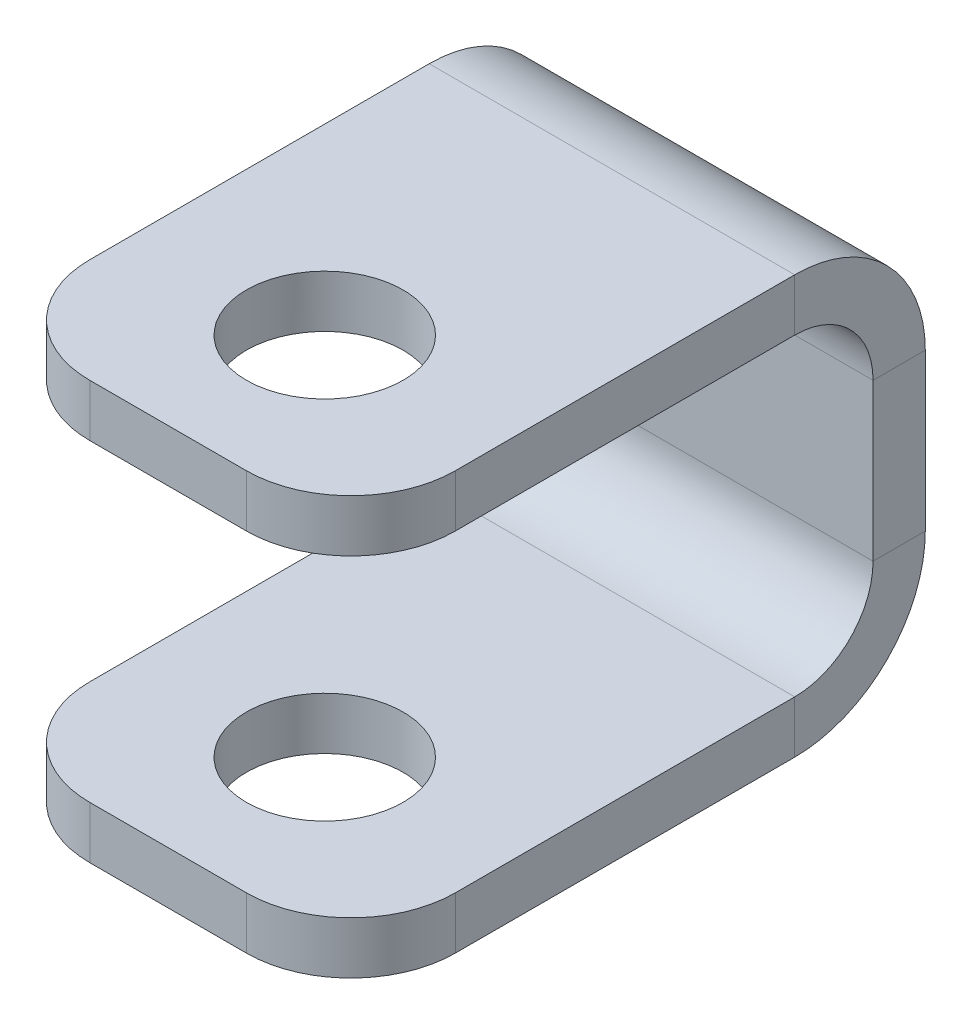
ISO-10303-21;
HEADER;
FILE_DESCRIPTION(('STEP AP214'),'2;1');
FILE_NAME('part.step','',(''),(''),'','','');
FILE_SCHEMA(('AUTOMOTIVE_DESIGN { 1 0 10303 214 1 1 1 1 }'));
ENDSEC;
DATA;
#1=APPLICATION_CONTEXT('core data for automotive mechanical design processes');
#2=APPLICATION_PROTOCOL_DEFINITION('international standard','automotive_design',2000,#1);
#3=PRODUCT_CONTEXT('',#1,'mechanical');
#4=PRODUCT('Part','Part','',(#3));
#5=PRODUCT_RELATED_PRODUCT_CATEGORY('part','',(#4));
#6=PRODUCT_DEFINITION_FORMATION('','',#4);
#7=PRODUCT_DEFINITION_CONTEXT('part definition',#1,'design');
#8=PRODUCT_DEFINITION('design','',#6,#7);
#9=PRODUCT_DEFINITION_SHAPE('','',#8);
#10=(LENGTH_UNIT() NAMED_UNIT(*) SI_UNIT(.MILLI.,.METRE.));
#11=(NAMED_UNIT(*) PLANE_ANGLE_UNIT() SI_UNIT($,.RADIAN.));
#12=(NAMED_UNIT(*) SI_UNIT($,.STERADIAN.) SOLID_ANGLE_UNIT());
#13=UNCERTAINTY_MEASURE_WITH_UNIT(LENGTH_MEASURE(1.E-05),#10,'distance_accuracy_value','');
#14=(GEOMETRIC_REPRESENTATION_CONTEXT(3) GLOBAL_UNCERTAINTY_ASSIGNED_CONTEXT((#13)) GLOBAL_UNIT_ASSIGNED_CONTEXT((#10,
#11,#12)) REPRESENTATION_CONTEXT('',''));
#15=CARTESIAN_POINT('',(0.,0.,0.));
#16=DIRECTION('',(0.,0.,1.));
#17=DIRECTION('',(1.,0.,0.));
#18=AXIS2_PLACEMENT_3D('',#15,#16,#17);
#19=CARTESIAN_POINT('',(14.2875000000006,12.7,3.175));
#20=DIRECTION('',(1.,0.,0.));
#21=DIRECTION('',(0.,0.,-1.));
#22=AXIS2_PLACEMENT_3D('',#19,#20,#21);
#23=PLANE('',#22);
#24=DIRECTION('',(0.,0.,-1.));
#25=VECTOR('',#24,1.);
#26=CARTESIAN_POINT('',(14.2875000000006,-4.76250000000002,3.175));
#27=LINE('',#26,#25);
#28=CARTESIAN_POINT('',(14.2875000000006,-4.76249999999999,3.175));
#29=VERTEX_POINT('',#28);
#30=CARTESIAN_POINT('',(14.2875000000006,-4.76249999999999,0.));
#31=VERTEX_POINT('',#30);
#32=EDGE_CURVE('E310',#29,#31,#27,.T.);
#33=ORIENTED_EDGE('',*,*,#32,.F.);
#34=DIRECTION('',(0.,-1.,0.));
#35=VECTOR('',#34,1.);
#36=CARTESIAN_POINT('',(14.2875000000006,12.7,3.175));
#37=LINE('',#36,#35);
#38=CARTESIAN_POINT('',(14.2875000000006,4.76250000000002,3.175));
#39=VERTEX_POINT('',#38);
#40=EDGE_CURVE('E383',#39,#29,#37,.T.);
#41=ORIENTED_EDGE('',*,*,#40,.F.);
#42=DIRECTION('',(0.,0.,-1.));
#43=VECTOR('',#42,1.);
#44=CARTESIAN_POINT('',(14.2875000000006,4.76250000000002,3.175));
#45=LINE('',#44,#43);
#46=CARTESIAN_POINT('',(14.2875000000006,4.76250000000002,0.));
#47=VERTEX_POINT('',#46);
#48=EDGE_CURVE('E361',#39,#47,#45,.T.);
#49=ORIENTED_EDGE('',*,*,#48,.T.);
#50=DIRECTION('',(0.,-1.,0.));
#51=VECTOR('',#50,1.);
#52=CARTESIAN_POINT('',(14.2875000000006,12.7,0.));
#53=LINE('',#52,#51);
#54=EDGE_CURVE('E380',#47,#31,#53,.T.);
#55=ORIENTED_EDGE('',*,*,#54,.T.);
#56=EDGE_LOOP('',(#33,#41,#49,#55));
#57=FACE_BOUND('',#56,.T.);
#58=ADVANCED_FACE('F91',(#57),#23,.F.);
#59=CARTESIAN_POINT('',(36.5125000000006,12.7,3.175));
#60=DIRECTION('',(-1.,0.,0.));
#61=DIRECTION('',(0.,0.,1.));
#62=AXIS2_PLACEMENT_3D('',#59,#60,#61);
#63=PLANE('',#62);
#64=DIRECTION('',(0.,0.,-1.));
#65=VECTOR('',#64,1.);
#66=CARTESIAN_POINT('',(36.5125000000006,-4.76250000000002,3.175));
#67=LINE('',#66,#65);
#68=CARTESIAN_POINT('',(36.5125000000006,-4.76250000000002,3.175));
#69=VERTEX_POINT('',#68);
#70=CARTESIAN_POINT('',(36.5125000000006,-4.76250000000002,0.));
#71=VERTEX_POINT('',#70);
#72=EDGE_CURVE('E299',#69,#71,#67,.T.);
#73=ORIENTED_EDGE('',*,*,#72,.T.);
#74=DIRECTION('',(0.,1.,0.));
#75=VECTOR('',#74,1.);
#76=CARTESIAN_POINT('',(36.5125000000006,12.7,0.));
#77=LINE('',#76,#75);
#78=CARTESIAN_POINT('',(36.5125000000006,4.76250000000002,0.));
#79=VERTEX_POINT('',#78);
#80=EDGE_CURVE('E388',#71,#79,#77,.T.);
#81=ORIENTED_EDGE('',*,*,#80,.T.);
#82=DIRECTION('',(0.,0.,-1.));
#83=VECTOR('',#82,1.);
#84=CARTESIAN_POINT('',(36.5125000000006,4.76250000000002,3.175));
#85=LINE('',#84,#83);
#86=CARTESIAN_POINT('',(36.5125000000006,4.76250000000002,3.175));
#87=VERTEX_POINT('',#86);
#88=EDGE_CURVE('E376',#87,#79,#85,.T.);
#89=ORIENTED_EDGE('',*,*,#88,.F.);
#90=DIRECTION('',(0.,1.,0.));
#91=VECTOR('',#90,1.);
#92=CARTESIAN_POINT('',(36.5125000000006,12.7,3.175));
#93=LINE('',#92,#91);
#94=EDGE_CURVE('E387',#69,#87,#93,.T.);
#95=ORIENTED_EDGE('',*,*,#94,.F.);
#96=EDGE_LOOP('',(#73,#81,#89,#95));
#97=FACE_BOUND('',#96,.T.);
#98=ADVANCED_FACE('F522',(#97),#63,.F.);
#99=CARTESIAN_POINT('',(0.,0.,3.175));
#100=DIRECTION('',(0.,0.,1.));
#101=DIRECTION('',(1.,0.,0.));
#102=AXIS2_PLACEMENT_3D('',#99,#100,#101);
#103=PLANE('',#102);
#104=ORIENTED_EDGE('',*,*,#40,.T.);
#105=DIRECTION('',(1.,0.,0.));
#106=VECTOR('',#105,1.);
#107=CARTESIAN_POINT('',(36.5125000000006,-4.76250000000002,3.175));
#108=LINE('',#107,#106);
#109=EDGE_CURVE('E304',#69,#29,#108,.F.);
#110=ORIENTED_EDGE('',*,*,#109,.F.);
#111=ORIENTED_EDGE('',*,*,#94,.T.);
#112=DIRECTION('',(-1.,0.,0.));
#113=VECTOR('',#112,1.);
#114=CARTESIAN_POINT('',(14.2875000000006,4.76250000000002,3.175));
#115=LINE('',#114,#113);
#116=EDGE_CURVE('E369',#39,#87,#115,.F.);
#117=ORIENTED_EDGE('',*,*,#116,.F.);
#118=EDGE_LOOP('',(#104,#110,#111,#117));
#119=FACE_BOUND('',#118,.T.);
#120=ADVANCED_FACE('F466',(#119),#103,.T.);
#121=CARTESIAN_POINT('',(0.,0.,0.));
#122=DIRECTION('',(0.,0.,1.));
#123=DIRECTION('',(1.,0.,0.));
#124=AXIS2_PLACEMENT_3D('',#121,#122,#123);
#125=PLANE('',#124);
#126=DIRECTION('',(1.,0.,0.));
#127=VECTOR('',#126,1.);
#128=CARTESIAN_POINT('',(36.5125000000006,-4.76250000000002,0.));
#129=LINE('',#128,#127);
#130=EDGE_CURVE('E244',#71,#31,#129,.F.);
#131=ORIENTED_EDGE('',*,*,#130,.T.);
#132=ORIENTED_EDGE('',*,*,#54,.F.);
#133=DIRECTION('',(-1.,0.,0.));
#134=VECTOR('',#133,1.);
#135=CARTESIAN_POINT('',(14.2875000000006,4.76250000000002,0.));
#136=LINE('',#135,#134);
#137=EDGE_CURVE('E352',#47,#79,#136,.F.);
#138=ORIENTED_EDGE('',*,*,#137,.T.);
#139=ORIENTED_EDGE('',*,*,#80,.F.);
#140=EDGE_LOOP('',(#131,#132,#138,#139));
#141=FACE_BOUND('',#140,.T.);
#142=ADVANCED_FACE('F529',(#141),#125,.F.);
#143=CARTESIAN_POINT('',(36.5125000000006,4.76250000000002,7.9375));
#144=DIRECTION('',(1.,0.,0.));
#145=DIRECTION('',(0.,0.,-1.));
#146=AXIS2_PLACEMENT_3D('',#143,#144,#145);
#147=PLANE('',#146);
#148=DIRECTION('',(0.,-1.,0.));
#149=VECTOR('',#148,1.);
#150=CARTESIAN_POINT('',(36.5125000000006,12.7,7.93749999999997));
#151=LINE('',#150,#149);
#152=CARTESIAN_POINT('',(36.5125000000006,9.52500000000002,7.93749999999998));
#153=VERTEX_POINT('',#152);
#154=CARTESIAN_POINT('',(36.5125000000006,12.7,7.93749999999997));
#155=VERTEX_POINT('',#154);
#156=EDGE_CURVE('E314',#153,#155,#151,.F.);
#157=ORIENTED_EDGE('',*,*,#156,.F.);
#158=CARTESIAN_POINT('',(36.5125000000006,4.76250000000002,7.9375));
#159=DIRECTION('',(-1.,0.,0.));
#160=DIRECTION('',(0.,0.,1.));
#161=AXIS2_PLACEMENT_3D('',#158,#159,#160);
#162=CIRCLE('',#161,4.7625);
#163=EDGE_CURVE('E365',#87,#153,#162,.F.);
#164=ORIENTED_EDGE('',*,*,#163,.F.);
#165=ORIENTED_EDGE('',*,*,#88,.T.);
#166=CARTESIAN_POINT('',(36.5125000000006,4.76250000000002,7.9375));
#167=DIRECTION('',(-1.,0.,0.));
#168=DIRECTION('',(0.,0.,1.));
#169=AXIS2_PLACEMENT_3D('',#166,#167,#168);
#170=CIRCLE('',#169,7.9375);
#171=EDGE_CURVE('E356',#79,#155,#170,.F.);
#172=ORIENTED_EDGE('',*,*,#171,.T.);
#173=EDGE_LOOP('',(#157,#164,#165,#172));
#174=FACE_BOUND('',#173,.T.);
#175=ADVANCED_FACE('F476',(#174),#147,.T.);
#176=CARTESIAN_POINT('',(14.2875000000006,4.76250000000002,7.9375));
#177=DIRECTION('',(1.,0.,0.));
#178=DIRECTION('',(0.,0.,-1.));
#179=AXIS2_PLACEMENT_3D('',#176,#177,#178);
#180=PLANE('',#179);
#181=CARTESIAN_POINT('',(14.2875000000006,4.76250000000002,7.9375));
#182=DIRECTION('',(-1.,0.,0.));
#183=DIRECTION('',(0.,0.,1.));
#184=AXIS2_PLACEMENT_3D('',#181,#182,#183);
#185=CIRCLE('',#184,4.7625);
#186=CARTESIAN_POINT('',(14.2875000000006,9.52500000000002,7.93749999999998));
#187=VERTEX_POINT('',#186);
#188=EDGE_CURVE('E320',#187,#39,#185,.T.);
#189=ORIENTED_EDGE('',*,*,#188,.F.);
#190=DIRECTION('',(0.,-1.,0.));
#191=VECTOR('',#190,1.);
#192=CARTESIAN_POINT('',(14.2875000000006,9.52500000000002,7.93749999999998));
#193=LINE('',#192,#191);
#194=CARTESIAN_POINT('',(14.2875000000006,12.7,7.93749999999997));
#195=VERTEX_POINT('',#194);
#196=EDGE_CURVE('E342',#187,#195,#193,.F.);
#197=ORIENTED_EDGE('',*,*,#196,.T.);
#198=CARTESIAN_POINT('',(14.2875000000006,4.76250000000002,7.9375));
#199=DIRECTION('',(-1.,0.,0.));
#200=DIRECTION('',(0.,0.,1.));
#201=AXIS2_PLACEMENT_3D('',#198,#199,#200);
#202=CIRCLE('',#201,7.9375);
#203=EDGE_CURVE('E357',#195,#47,#202,.T.);
#204=ORIENTED_EDGE('',*,*,#203,.T.);
#205=ORIENTED_EDGE('',*,*,#48,.F.);
#206=EDGE_LOOP('',(#189,#197,#204,#205));
#207=FACE_BOUND('',#206,.T.);
#208=ADVANCED_FACE('F489',(#207),#180,.F.);
#209=CARTESIAN_POINT('',(14.2875000000006,4.76250000000002,7.9375));
#210=DIRECTION('',(-1.,0.,0.));
#211=DIRECTION('',(0.,1.,0.));
#212=AXIS2_PLACEMENT_3D('',#209,#210,#211);
#213=CYLINDRICAL_SURFACE('',#212,7.9375);
#214=ORIENTED_EDGE('',*,*,#137,.F.);
#215=ORIENTED_EDGE('',*,*,#203,.F.);
#216=DIRECTION('',(-1.,0.,0.));
#217=VECTOR('',#216,1.);
#218=CARTESIAN_POINT('',(36.5125000000006,12.7,7.93749999999997));
#219=LINE('',#218,#217);
#220=EDGE_CURVE('E338',#195,#155,#219,.F.);
#221=ORIENTED_EDGE('',*,*,#220,.T.);
#222=ORIENTED_EDGE('',*,*,#171,.F.);
#223=EDGE_LOOP('',(#214,#215,#221,#222));
#224=FACE_BOUND('',#223,.T.);
#225=ADVANCED_FACE('F537',(#224),#213,.T.);
#226=CARTESIAN_POINT('',(14.2875000000006,4.76250000000002,7.9375));
#227=DIRECTION('',(-1.,0.,0.));
#228=DIRECTION('',(0.,1.,0.));
#229=AXIS2_PLACEMENT_3D('',#226,#227,#228);
#230=CYLINDRICAL_SURFACE('',#229,4.7625);
#231=ORIENTED_EDGE('',*,*,#116,.T.);
#232=ORIENTED_EDGE('',*,*,#163,.T.);
#233=DIRECTION('',(-1.,0.,0.));
#234=VECTOR('',#233,1.);
#235=CARTESIAN_POINT('',(36.5125000000006,9.52500000000002,7.93749999999998));
#236=LINE('',#235,#234);
#237=EDGE_CURVE('E346',#153,#187,#236,.T.);
#238=ORIENTED_EDGE('',*,*,#237,.T.);
#239=ORIENTED_EDGE('',*,*,#188,.T.);
#240=EDGE_LOOP('',(#231,#232,#238,#239));
#241=FACE_BOUND('',#240,.T.);
#242=ADVANCED_FACE('F471',(#241),#230,.F.);
#243=CARTESIAN_POINT('',(14.2875000000006,12.7000000000001,34.9250000000007));
#244=DIRECTION('',(1.,0.,0.));
#245=DIRECTION('',(0.,0.,-1.));
#246=AXIS2_PLACEMENT_3D('',#243,#244,#245);
#247=PLANE('',#246);
#248=DIRECTION('',(0.,0.,-1.));
#249=VECTOR('',#248,1.);
#250=CARTESIAN_POINT('',(14.2875000000006,9.52500000000011,34.9250000000007));
#251=LINE('',#250,#249);
#252=CARTESIAN_POINT('',(14.2875000000006,9.52500000000009,28.5750000000007));
#253=VERTEX_POINT('',#252);
#254=EDGE_CURVE('E334',#187,#253,#251,.F.);
#255=ORIENTED_EDGE('',*,*,#254,.T.);
#256=DIRECTION('',(0.,-1.,0.));
#257=VECTOR('',#256,1.);
#258=CARTESIAN_POINT('',(14.2875000000006,12.7000000000001,28.5750000000007));
#259=LINE('',#258,#257);
#260=CARTESIAN_POINT('',(14.2875000000006,12.7000000000001,28.5750000000007));
#261=VERTEX_POINT('',#260);
#262=EDGE_CURVE('E420',#253,#261,#259,.F.);
#263=ORIENTED_EDGE('',*,*,#262,.T.);
#264=DIRECTION('',(0.,0.,1.));
#265=VECTOR('',#264,1.);
#266=CARTESIAN_POINT('',(14.2875000000006,12.7,0.));
#267=LINE('',#266,#265);
#268=EDGE_CURVE('E324',#195,#261,#267,.T.);
#269=ORIENTED_EDGE('',*,*,#268,.F.);
#270=ORIENTED_EDGE('',*,*,#196,.F.);
#271=EDGE_LOOP('',(#255,#263,#269,#270));
#272=FACE_BOUND('',#271,.T.);
#273=ADVANCED_FACE('F493',(#272),#247,.F.);
#274=CARTESIAN_POINT('',(36.5125000000006,12.7,3.17499999999999));
#275=DIRECTION('',(-1.,0.,0.));
#276=DIRECTION('',(0.,0.,1.));
#277=AXIS2_PLACEMENT_3D('',#274,#275,#276);
#278=PLANE('',#277);
#279=DIRECTION('',(0.,0.,-1.));
#280=VECTOR('',#279,1.);
#281=CARTESIAN_POINT('',(36.5125000000006,12.7,0.));
#282=LINE('',#281,#280);
#283=CARTESIAN_POINT('',(36.5125000000006,12.7000000000001,28.5750000000007));
#284=VERTEX_POINT('',#283);
#285=EDGE_CURVE('E317',#284,#155,#282,.T.);
#286=ORIENTED_EDGE('',*,*,#285,.F.);
#287=DIRECTION('',(0.,-1.,0.));
#288=VECTOR('',#287,1.);
#289=CARTESIAN_POINT('',(36.5125000000006,12.7000000000001,28.5750000000007));
#290=LINE('',#289,#288);
#291=CARTESIAN_POINT('',(36.5125000000006,9.52500000000009,28.5750000000007));
#292=VERTEX_POINT('',#291);
#293=EDGE_CURVE('E391',#284,#292,#290,.T.);
#294=ORIENTED_EDGE('',*,*,#293,.T.);
#295=DIRECTION('',(0.,0.,1.));
#296=VECTOR('',#295,1.);
#297=CARTESIAN_POINT('',(36.5125000000006,9.525,3.175));
#298=LINE('',#297,#296);
#299=EDGE_CURVE('E328',#292,#153,#298,.F.);
#300=ORIENTED_EDGE('',*,*,#299,.T.);
#301=ORIENTED_EDGE('',*,*,#156,.T.);
#302=EDGE_LOOP('',(#286,#294,#300,#301));
#303=FACE_BOUND('',#302,.T.);
#304=ADVANCED_FACE('F480',(#303),#278,.F.);
#305=CARTESIAN_POINT('',(0.,12.7,0.));
#306=DIRECTION('',(0.,-1.,0.));
#307=DIRECTION('',(0.,0.,-1.));
#308=AXIS2_PLACEMENT_3D('',#305,#306,#307);
#309=PLANE('',#308);
#310=CARTESIAN_POINT('',(25.4000000000006,12.7000000000001,25.4000000000008));
#311=DIRECTION('',(0.,1.,0.));
#312=DIRECTION('',(0.,0.,1.));
#313=AXIS2_PLACEMENT_3D('',#310,#311,#312);
#314=CIRCLE('',#313,4.7625);
#315=CARTESIAN_POINT('',(25.4000000000006,12.7000000000001,30.1625000000008));
#316=VERTEX_POINT('',#315);
#317=EDGE_CURVE('E583',#316,#316,#314,.T.);
#318=ORIENTED_EDGE('',*,*,#317,.F.);
#319=EDGE_LOOP('',(#318));
#320=FACE_BOUND('',#319,.T.);
#321=DIRECTION('',(1.,0.,0.));
#322=VECTOR('',#321,1.);
#323=CARTESIAN_POINT('',(0.,12.7000000000001,34.9250000000007));
#324=LINE('',#323,#322);
#325=CARTESIAN_POINT('',(20.6375000000006,12.7000000000001,34.9250000000007));
#326=VERTEX_POINT('',#325);
#327=CARTESIAN_POINT('',(30.1625000000006,12.7000000000001,34.9250000000007));
#328=VERTEX_POINT('',#327);
#329=EDGE_CURVE('E321',#326,#328,#324,.T.);
#330=ORIENTED_EDGE('',*,*,#329,.T.);
#331=CARTESIAN_POINT('',(30.1625000000006,12.7000000000001,28.5750000000007));
#332=DIRECTION('',(0.,-1.,0.));
#333=DIRECTION('',(0.,0.,-1.));
#334=AXIS2_PLACEMENT_3D('',#331,#332,#333);
#335=CIRCLE('',#334,6.35);
#336=EDGE_CURVE('E418',#328,#284,#335,.F.);
#337=ORIENTED_EDGE('',*,*,#336,.T.);
#338=ORIENTED_EDGE('',*,*,#285,.T.);
#339=ORIENTED_EDGE('',*,*,#220,.F.);
#340=ORIENTED_EDGE('',*,*,#268,.T.);
#341=CARTESIAN_POINT('',(20.6375000000006,12.7000000000001,28.5750000000007));
#342=DIRECTION('',(0.,-1.,0.));
#343=DIRECTION('',(0.,0.,-1.));
#344=AXIS2_PLACEMENT_3D('',#341,#342,#343);
#345=CIRCLE('',#344,6.35);
#346=EDGE_CURVE('E416',#261,#326,#345,.F.);
#347=ORIENTED_EDGE('',*,*,#346,.T.);
#348=EDGE_LOOP('',(#330,#337,#338,#339,#340,#347));
#349=FACE_BOUND('',#348,.T.);
#350=ADVANCED_FACE('F497',(#320,#349),#309,.F.);
#351=CARTESIAN_POINT('',(0.,9.52499999999999,0.));
#352=DIRECTION('',(0.,-1.,0.));
#353=DIRECTION('',(0.,0.,-1.));
#354=AXIS2_PLACEMENT_3D('',#351,#352,#353);
#355=PLANE('',#354);
#356=CARTESIAN_POINT('',(25.4000000000006,9.52500000000008,25.4000000000008));
#357=DIRECTION('',(0.,-1.,0.));
#358=DIRECTION('',(0.,0.,-1.));
#359=AXIS2_PLACEMENT_3D('',#356,#357,#358);
#360=CIRCLE('',#359,4.7625);
#361=CARTESIAN_POINT('',(25.4000000000006,9.52500000000006,20.6375000000008));
#362=VERTEX_POINT('',#361);
#363=EDGE_CURVE('E294',#362,#362,#360,.T.);
#364=ORIENTED_EDGE('',*,*,#363,.F.);
#365=EDGE_LOOP('',(#364));
#366=FACE_BOUND('',#365,.T.);
#367=ORIENTED_EDGE('',*,*,#299,.F.);
#368=CARTESIAN_POINT('',(30.1625000000006,9.52500000000009,28.5750000000007));
#369=DIRECTION('',(0.,-1.,0.));
#370=DIRECTION('',(0.,0.,-1.));
#371=AXIS2_PLACEMENT_3D('',#368,#369,#370);
#372=CIRCLE('',#371,6.35);
#373=CARTESIAN_POINT('',(30.1625000000006,9.52500000000011,34.9250000000007));
#374=VERTEX_POINT('',#373);
#375=EDGE_CURVE('E408',#292,#374,#372,.T.);
#376=ORIENTED_EDGE('',*,*,#375,.T.);
#377=DIRECTION('',(-1.,0.,0.));
#378=VECTOR('',#377,1.);
#379=CARTESIAN_POINT('',(36.5125000000006,9.52500000000011,34.9250000000007));
#380=LINE('',#379,#378);
#381=CARTESIAN_POINT('',(20.6375000000006,9.52500000000011,34.9250000000007));
#382=VERTEX_POINT('',#381);
#383=EDGE_CURVE('E331',#382,#374,#380,.F.);
#384=ORIENTED_EDGE('',*,*,#383,.F.);
#385=CARTESIAN_POINT('',(20.6375000000006,9.52500000000009,28.5750000000007));
#386=DIRECTION('',(0.,-1.,0.));
#387=DIRECTION('',(0.,0.,-1.));
#388=AXIS2_PLACEMENT_3D('',#385,#386,#387);
#389=CIRCLE('',#388,6.35);
#390=EDGE_CURVE('E405',#382,#253,#389,.T.);
#391=ORIENTED_EDGE('',*,*,#390,.T.);
#392=ORIENTED_EDGE('',*,*,#254,.F.);
#393=ORIENTED_EDGE('',*,*,#237,.F.);
#394=EDGE_LOOP('',(#367,#376,#384,#391,#392,#393));
#395=FACE_BOUND('',#394,.T.);
#396=ADVANCED_FACE('F484',(#366,#395),#355,.T.);
#397=CARTESIAN_POINT('',(36.5125000000006,12.7000000000001,34.9250000000007));
#398=DIRECTION('',(0.,0.,-1.));
#399=DIRECTION('',(0.,1.,0.));
#400=AXIS2_PLACEMENT_3D('',#397,#398,#399);
#401=PLANE('',#400);
#402=ORIENTED_EDGE('',*,*,#383,.T.);
#403=DIRECTION('',(0.,-1.,0.));
#404=VECTOR('',#403,1.);
#405=CARTESIAN_POINT('',(30.1625000000006,12.7000000000001,34.9250000000007));
#406=LINE('',#405,#404);
#407=EDGE_CURVE('E414',#374,#328,#406,.F.);
#408=ORIENTED_EDGE('',*,*,#407,.T.);
#409=ORIENTED_EDGE('',*,*,#329,.F.);
#410=DIRECTION('',(0.,-1.,0.));
#411=VECTOR('',#410,1.);
#412=CARTESIAN_POINT('',(20.6375000000006,12.7000000000001,34.9250000000007));
#413=LINE('',#412,#411);
#414=EDGE_CURVE('E410',#326,#382,#413,.T.);
#415=ORIENTED_EDGE('',*,*,#414,.T.);
#416=EDGE_LOOP('',(#402,#408,#409,#415));
#417=FACE_BOUND('',#416,.T.);
#418=ADVANCED_FACE('F503',(#417),#401,.F.);
#419=CARTESIAN_POINT('',(14.2875000000006,-4.76250000000002,7.9375));
#420=DIRECTION('',(-1.,0.,0.));
#421=DIRECTION('',(0.,0.,1.));
#422=AXIS2_PLACEMENT_3D('',#419,#420,#421);
#423=PLANE('',#422);
#424=DIRECTION('',(0.,1.,0.));
#425=VECTOR('',#424,1.);
#426=CARTESIAN_POINT('',(14.2875000000006,-12.7,7.93749999999997));
#427=LINE('',#426,#425);
#428=CARTESIAN_POINT('',(14.2875000000006,-9.52500000000002,7.93749999999998));
#429=VERTEX_POINT('',#428);
#430=CARTESIAN_POINT('',(14.2875000000006,-12.7,7.93749999999997));
#431=VERTEX_POINT('',#430);
#432=EDGE_CURVE('E290',#429,#431,#427,.F.);
#433=ORIENTED_EDGE('',*,*,#432,.F.);
#434=CARTESIAN_POINT('',(14.2875000000006,-4.76250000000002,7.9375));
#435=DIRECTION('',(1.,0.,0.));
#436=DIRECTION('',(0.,0.,-1.));
#437=AXIS2_PLACEMENT_3D('',#434,#435,#436);
#438=CIRCLE('',#437,4.7625);
#439=EDGE_CURVE('E248',#29,#429,#438,.F.);
#440=ORIENTED_EDGE('',*,*,#439,.F.);
#441=ORIENTED_EDGE('',*,*,#32,.T.);
#442=CARTESIAN_POINT('',(14.2875000000006,-4.76250000000002,7.9375));
#443=DIRECTION('',(1.,0.,0.));
#444=DIRECTION('',(0.,0.,-1.));
#445=AXIS2_PLACEMENT_3D('',#442,#443,#444);
#446=CIRCLE('',#445,7.9375);
#447=EDGE_CURVE('E297',#31,#431,#446,.F.);
#448=ORIENTED_EDGE('',*,*,#447,.T.);
#449=EDGE_LOOP('',(#433,#440,#441,#448));
#450=FACE_BOUND('',#449,.T.);
#451=ADVANCED_FACE('F460',(#450),#423,.T.);
#452=CARTESIAN_POINT('',(36.5125000000006,-4.76250000000002,7.9375));
#453=DIRECTION('',(-1.,0.,0.));
#454=DIRECTION('',(0.,0.,1.));
#455=AXIS2_PLACEMENT_3D('',#452,#453,#454);
#456=PLANE('',#455);
#457=CARTESIAN_POINT('',(36.5125000000006,-4.76250000000002,7.9375));
#458=DIRECTION('',(1.,0.,0.));
#459=DIRECTION('',(0.,0.,-1.));
#460=AXIS2_PLACEMENT_3D('',#457,#458,#459);
#461=CIRCLE('',#460,4.7625);
#462=CARTESIAN_POINT('',(36.5125000000006,-9.52500000000002,7.93749999999998));
#463=VERTEX_POINT('',#462);
#464=EDGE_CURVE('E255',#463,#69,#461,.T.);
#465=ORIENTED_EDGE('',*,*,#464,.F.);
#466=DIRECTION('',(0.,1.,0.));
#467=VECTOR('',#466,1.);
#468=CARTESIAN_POINT('',(36.5125000000006,-9.52500000000002,7.93749999999998));
#469=LINE('',#468,#467);
#470=CARTESIAN_POINT('',(36.5125000000006,-12.7,7.93749999999997));
#471=VERTEX_POINT('',#470);
#472=EDGE_CURVE('E252',#463,#471,#469,.F.);
#473=ORIENTED_EDGE('',*,*,#472,.T.);
#474=CARTESIAN_POINT('',(36.5125000000006,-4.76250000000002,7.9375));
#475=DIRECTION('',(1.,0.,0.));
#476=DIRECTION('',(0.,0.,-1.));
#477=AXIS2_PLACEMENT_3D('',#474,#475,#476);
#478=CIRCLE('',#477,7.9375);
#479=EDGE_CURVE('E237',#471,#71,#478,.T.);
#480=ORIENTED_EDGE('',*,*,#479,.T.);
#481=ORIENTED_EDGE('',*,*,#72,.F.);
#482=EDGE_LOOP('',(#465,#473,#480,#481));
#483=FACE_BOUND('',#482,.T.);
#484=ADVANCED_FACE('F253',(#483),#456,.F.);
#485=CARTESIAN_POINT('',(36.5125000000006,-4.76250000000002,7.9375));
#486=DIRECTION('',(1.,0.,0.));
#487=DIRECTION('',(0.,-1.,0.));
#488=AXIS2_PLACEMENT_3D('',#485,#486,#487);
#489=CYLINDRICAL_SURFACE('',#488,7.9375);
#490=ORIENTED_EDGE('',*,*,#130,.F.);
#491=ORIENTED_EDGE('',*,*,#479,.F.);
#492=DIRECTION('',(1.,0.,0.));
#493=VECTOR('',#492,1.);
#494=CARTESIAN_POINT('',(14.2875000000006,-12.7,7.93749999999997));
#495=LINE('',#494,#493);
#496=EDGE_CURVE('E242',#471,#431,#495,.F.);
#497=ORIENTED_EDGE('',*,*,#496,.T.);
#498=ORIENTED_EDGE('',*,*,#447,.F.);
#499=EDGE_LOOP('',(#490,#491,#497,#498));
#500=FACE_BOUND('',#499,.T.);
#501=ADVANCED_FACE('F239',(#500),#489,.T.);
#502=CARTESIAN_POINT('',(36.5125000000006,-4.76250000000002,7.9375));
#503=DIRECTION('',(1.,0.,0.));
#504=DIRECTION('',(0.,-1.,0.));
#505=AXIS2_PLACEMENT_3D('',#502,#503,#504);
#506=CYLINDRICAL_SURFACE('',#505,4.7625);
#507=ORIENTED_EDGE('',*,*,#109,.T.);
#508=ORIENTED_EDGE('',*,*,#439,.T.);
#509=DIRECTION('',(1.,0.,0.));
#510=VECTOR('',#509,1.);
#511=CARTESIAN_POINT('',(14.2875000000006,-9.52500000000002,7.93749999999998));
#512=LINE('',#511,#510);
#513=EDGE_CURVE('E258',#429,#463,#512,.T.);
#514=ORIENTED_EDGE('',*,*,#513,.T.);
#515=ORIENTED_EDGE('',*,*,#464,.T.);
#516=EDGE_LOOP('',(#507,#508,#514,#515));
#517=FACE_BOUND('',#516,.T.);
#518=ADVANCED_FACE('F457',(#517),#506,.F.);
#519=CARTESIAN_POINT('',(14.2875000000006,-12.7,3.17499999999999));
#520=DIRECTION('',(1.,0.,0.));
#521=DIRECTION('',(0.,0.,-1.));
#522=AXIS2_PLACEMENT_3D('',#519,#520,#521);
#523=PLANE('',#522);
#524=DIRECTION('',(0.,0.,-1.));
#525=VECTOR('',#524,1.);
#526=CARTESIAN_POINT('',(14.2875000000006,-12.7,0.));
#527=LINE('',#526,#525);
#528=CARTESIAN_POINT('',(14.2875000000006,-12.7000000000001,28.5750000000006));
#529=VERTEX_POINT('',#528);
#530=EDGE_CURVE('E265',#529,#431,#527,.T.);
#531=ORIENTED_EDGE('',*,*,#530,.F.);
#532=DIRECTION('',(0.,1.,0.));
#533=VECTOR('',#532,1.);
#534=CARTESIAN_POINT('',(14.2875000000006,-12.7000000000001,28.5750000000006));
#535=LINE('',#534,#533);
#536=CARTESIAN_POINT('',(14.2875000000006,-9.52500000000009,28.5750000000006));
#537=VERTEX_POINT('',#536);
#538=EDGE_CURVE('E423',#529,#537,#535,.T.);
#539=ORIENTED_EDGE('',*,*,#538,.T.);
#540=DIRECTION('',(0.,0.,1.));
#541=VECTOR('',#540,1.);
#542=CARTESIAN_POINT('',(14.2875000000006,-9.525,3.175));
#543=LINE('',#542,#541);
#544=EDGE_CURVE('E267',#537,#429,#543,.F.);
#545=ORIENTED_EDGE('',*,*,#544,.T.);
#546=ORIENTED_EDGE('',*,*,#432,.T.);
#547=EDGE_LOOP('',(#531,#539,#545,#546));
#548=FACE_BOUND('',#547,.T.);
#549=ADVANCED_FACE('F445',(#548),#523,.F.);
#550=CARTESIAN_POINT('',(36.5125000000006,-12.7000000000001,34.9250000000006));
#551=DIRECTION('',(-1.,0.,0.));
#552=DIRECTION('',(0.,0.,1.));
#553=AXIS2_PLACEMENT_3D('',#550,#551,#552);
#554=PLANE('',#553);
#555=DIRECTION('',(0.,0.,-1.));
#556=VECTOR('',#555,1.);
#557=CARTESIAN_POINT('',(36.5125000000006,-9.52500000000011,34.9250000000006));
#558=LINE('',#557,#556);
#559=CARTESIAN_POINT('',(36.5125000000006,-9.52500000000009,28.5750000000006));
#560=VERTEX_POINT('',#559);
#561=EDGE_CURVE('E284',#463,#560,#558,.F.);
#562=ORIENTED_EDGE('',*,*,#561,.T.);
#563=DIRECTION('',(0.,1.,0.));
#564=VECTOR('',#563,1.);
#565=CARTESIAN_POINT('',(36.5125000000006,-12.7000000000001,28.5750000000006));
#566=LINE('',#565,#564);
#567=CARTESIAN_POINT('',(36.5125000000006,-12.7000000000001,28.5750000000006));
#568=VERTEX_POINT('',#567);
#569=EDGE_CURVE('E13',#560,#568,#566,.F.);
#570=ORIENTED_EDGE('',*,*,#569,.T.);
#571=DIRECTION('',(0.,0.,1.));
#572=VECTOR('',#571,1.);
#573=CARTESIAN_POINT('',(36.5125000000006,-12.7,0.));
#574=LINE('',#573,#572);
#575=EDGE_CURVE('E262',#471,#568,#574,.T.);
#576=ORIENTED_EDGE('',*,*,#575,.F.);
#577=ORIENTED_EDGE('',*,*,#472,.F.);
#578=EDGE_LOOP('',(#562,#570,#576,#577));
#579=FACE_BOUND('',#578,.T.);
#580=ADVANCED_FACE('F269',(#579),#554,.F.);
#581=CARTESIAN_POINT('',(0.,-12.7,0.));
#582=DIRECTION('',(0.,1.,0.));
#583=DIRECTION('',(0.,0.,1.));
#584=AXIS2_PLACEMENT_3D('',#581,#582,#583);
#585=PLANE('',#584);
#586=CARTESIAN_POINT('',(25.4000000000006,-12.7000000000001,25.4000000000008));
#587=DIRECTION('',(0.,1.,0.));
#588=DIRECTION('',(0.,0.,1.));
#589=AXIS2_PLACEMENT_3D('',#586,#587,#588);
#590=CIRCLE('',#589,4.7625);
#591=CARTESIAN_POINT('',(25.4000000000006,-12.7000000000001,30.1625000000008));
#592=VERTEX_POINT('',#591);
#593=EDGE_CURVE('E401',#592,#592,#590,.T.);
#594=ORIENTED_EDGE('',*,*,#593,.T.);
#595=EDGE_LOOP('',(#594));
#596=FACE_BOUND('',#595,.T.);
#597=DIRECTION('',(-1.,0.,0.));
#598=VECTOR('',#597,1.);
#599=CARTESIAN_POINT('',(0.,-12.7000000000001,34.9250000000006));
#600=LINE('',#599,#598);
#601=CARTESIAN_POINT('',(30.1625000000006,-12.7000000000001,34.9250000000006));
#602=VERTEX_POINT('',#601);
#603=CARTESIAN_POINT('',(20.6375000000006,-12.7000000000001,34.9250000000006));
#604=VERTEX_POINT('',#603);
#605=EDGE_CURVE('E271',#602,#604,#600,.T.);
#606=ORIENTED_EDGE('',*,*,#605,.T.);
#607=CARTESIAN_POINT('',(20.6375000000006,-12.7000000000001,28.5750000000006));
#608=DIRECTION('',(0.,1.,0.));
#609=DIRECTION('',(0.,0.,1.));
#610=AXIS2_PLACEMENT_3D('',#607,#608,#609);
#611=CIRCLE('',#610,6.35);
#612=EDGE_CURVE('E100',#604,#529,#611,.F.);
#613=ORIENTED_EDGE('',*,*,#612,.T.);
#614=ORIENTED_EDGE('',*,*,#530,.T.);
#615=ORIENTED_EDGE('',*,*,#496,.F.);
#616=ORIENTED_EDGE('',*,*,#575,.T.);
#617=CARTESIAN_POINT('',(30.1625000000006,-12.7000000000001,28.5750000000006));
#618=DIRECTION('',(0.,1.,0.));
#619=DIRECTION('',(0.,0.,1.));
#620=AXIS2_PLACEMENT_3D('',#617,#618,#619);
#621=CIRCLE('',#620,6.35);
#622=EDGE_CURVE('E439',#568,#602,#621,.F.);
#623=ORIENTED_EDGE('',*,*,#622,.T.);
#624=EDGE_LOOP('',(#606,#613,#614,#615,#616,#623));
#625=FACE_BOUND('',#624,.T.);
#626=ADVANCED_FACE('F261',(#596,#625),#585,.F.);
#627=CARTESIAN_POINT('',(0.,-9.52499999999999,0.));
#628=DIRECTION('',(0.,1.,0.));
#629=DIRECTION('',(0.,0.,1.));
#630=AXIS2_PLACEMENT_3D('',#627,#628,#629);
#631=PLANE('',#630);
#632=CARTESIAN_POINT('',(25.4000000000006,-9.52500000000008,25.4000000000008));
#633=DIRECTION('',(0.,1.,0.));
#634=DIRECTION('',(0.,0.,1.));
#635=AXIS2_PLACEMENT_3D('',#632,#633,#634);
#636=CIRCLE('',#635,4.7625);
#637=CARTESIAN_POINT('',(25.4000000000006,-9.52500000000009,30.1625000000008));
#638=VERTEX_POINT('',#637);
#639=EDGE_CURVE('E397',#638,#638,#636,.T.);
#640=ORIENTED_EDGE('',*,*,#639,.F.);
#641=EDGE_LOOP('',(#640));
#642=FACE_BOUND('',#641,.T.);
#643=ORIENTED_EDGE('',*,*,#544,.F.);
#644=CARTESIAN_POINT('',(20.6375000000006,-9.52500000000009,28.5750000000006));
#645=DIRECTION('',(0.,1.,0.));
#646=DIRECTION('',(0.,0.,1.));
#647=AXIS2_PLACEMENT_3D('',#644,#645,#646);
#648=CIRCLE('',#647,6.35);
#649=CARTESIAN_POINT('',(20.6375000000006,-9.52500000000011,34.9250000000006));
#650=VERTEX_POINT('',#649);
#651=EDGE_CURVE('E430',#537,#650,#648,.T.);
#652=ORIENTED_EDGE('',*,*,#651,.T.);
#653=DIRECTION('',(1.,0.,0.));
#654=VECTOR('',#653,1.);
#655=CARTESIAN_POINT('',(14.2875000000006,-9.52500000000011,34.9250000000006));
#656=LINE('',#655,#654);
#657=CARTESIAN_POINT('',(30.1625000000006,-9.52500000000011,34.9250000000006));
#658=VERTEX_POINT('',#657);
#659=EDGE_CURVE('E278',#658,#650,#656,.F.);
#660=ORIENTED_EDGE('',*,*,#659,.F.);
#661=CARTESIAN_POINT('',(30.1625000000006,-9.52500000000009,28.5750000000006));
#662=DIRECTION('',(0.,1.,0.));
#663=DIRECTION('',(0.,0.,1.));
#664=AXIS2_PLACEMENT_3D('',#661,#662,#663);
#665=CIRCLE('',#664,6.35);
#666=EDGE_CURVE('E427',#658,#560,#665,.T.);
#667=ORIENTED_EDGE('',*,*,#666,.T.);
#668=ORIENTED_EDGE('',*,*,#561,.F.);
#669=ORIENTED_EDGE('',*,*,#513,.F.);
#670=EDGE_LOOP('',(#643,#652,#660,#667,#668,#669));
#671=FACE_BOUND('',#670,.T.);
#672=ADVANCED_FACE('F451',(#642,#671),#631,.T.);
#673=CARTESIAN_POINT('',(14.2875000000006,-12.7000000000001,34.9250000000006));
#674=DIRECTION('',(0.,0.,-1.));
#675=DIRECTION('',(0.,1.,0.));
#676=AXIS2_PLACEMENT_3D('',#673,#674,#675);
#677=PLANE('',#676);
#678=ORIENTED_EDGE('',*,*,#659,.T.);
#679=DIRECTION('',(0.,1.,0.));
#680=VECTOR('',#679,1.);
#681=CARTESIAN_POINT('',(20.6375000000006,-12.7000000000001,34.9250000000006));
#682=LINE('',#681,#680);
#683=EDGE_CURVE('E117',#650,#604,#682,.F.);
#684=ORIENTED_EDGE('',*,*,#683,.T.);
#685=ORIENTED_EDGE('',*,*,#605,.F.);
#686=DIRECTION('',(0.,1.,0.));
#687=VECTOR('',#686,1.);
#688=CARTESIAN_POINT('',(30.1625000000006,-12.7000000000001,34.9250000000006));
#689=LINE('',#688,#687);
#690=EDGE_CURVE('E433',#602,#658,#689,.T.);
#691=ORIENTED_EDGE('',*,*,#690,.T.);
#692=EDGE_LOOP('',(#678,#684,#685,#691));
#693=FACE_BOUND('',#692,.T.);
#694=ADVANCED_FACE('F453',(#693),#677,.F.);
#695=CARTESIAN_POINT('',(25.4000000000006,-12.7000000000001,25.4000000000008));
#696=DIRECTION('',(0.,1.,0.));
#697=DIRECTION('',(0.,0.,1.));
#698=AXIS2_PLACEMENT_3D('',#695,#696,#697);
#699=CYLINDRICAL_SURFACE('',#698,4.7625);
#700=ORIENTED_EDGE('',*,*,#639,.T.);
#701=EDGE_LOOP('',(#700));
#702=FACE_BOUND('',#701,.T.);
#703=ORIENTED_EDGE('',*,*,#593,.F.);
#704=EDGE_LOOP('',(#703));
#705=FACE_BOUND('',#704,.T.);
#706=ADVANCED_FACE('F517',(#702,#705),#699,.F.);
#707=ORIENTED_EDGE('',*,*,#363,.T.);
#708=EDGE_LOOP('',(#707));
#709=FACE_BOUND('',#708,.T.);
#710=ORIENTED_EDGE('',*,*,#317,.T.);
#711=EDGE_LOOP('',(#710));
#712=FACE_BOUND('',#711,.T.);
#713=ADVANCED_FACE('F509',(#709,#712),#699,.F.);
#714=CARTESIAN_POINT('',(30.1625000000006,12.7000000000001,28.5750000000007));
#715=DIRECTION('',(0.,-1.,0.));
#716=DIRECTION('',(0.,0.,-1.));
#717=AXIS2_PLACEMENT_3D('',#714,#715,#716);
#718=CYLINDRICAL_SURFACE('',#717,6.35);
#719=ORIENTED_EDGE('',*,*,#336,.F.);
#720=ORIENTED_EDGE('',*,*,#407,.F.);
#721=ORIENTED_EDGE('',*,*,#375,.F.);
#722=ORIENTED_EDGE('',*,*,#293,.F.);
#723=EDGE_LOOP('',(#719,#720,#721,#722));
#724=FACE_BOUND('',#723,.T.);
#725=ADVANCED_FACE('F507',(#724),#718,.T.);
#726=CARTESIAN_POINT('',(20.6375000000006,12.7000000000001,28.5750000000007));
#727=DIRECTION('',(0.,-1.,0.));
#728=DIRECTION('',(0.,0.,-1.));
#729=AXIS2_PLACEMENT_3D('',#726,#727,#728);
#730=CYLINDRICAL_SURFACE('',#729,6.35);
#731=ORIENTED_EDGE('',*,*,#346,.F.);
#732=ORIENTED_EDGE('',*,*,#262,.F.);
#733=ORIENTED_EDGE('',*,*,#390,.F.);
#734=ORIENTED_EDGE('',*,*,#414,.F.);
#735=EDGE_LOOP('',(#731,#732,#733,#734));
#736=FACE_BOUND('',#735,.T.);
#737=ADVANCED_FACE('F501',(#736),#730,.T.);
#738=CARTESIAN_POINT('',(20.6375000000006,-12.7000000000001,28.5750000000006));
#739=DIRECTION('',(0.,1.,0.));
#740=DIRECTION('',(0.,0.,1.));
#741=AXIS2_PLACEMENT_3D('',#738,#739,#740);
#742=CYLINDRICAL_SURFACE('',#741,6.35);
#743=ORIENTED_EDGE('',*,*,#612,.F.);
#744=ORIENTED_EDGE('',*,*,#683,.F.);
#745=ORIENTED_EDGE('',*,*,#651,.F.);
#746=ORIENTED_EDGE('',*,*,#538,.F.);
#747=EDGE_LOOP('',(#743,#744,#745,#746));
#748=FACE_BOUND('',#747,.T.);
#749=ADVANCED_FACE('F448',(#748),#742,.T.);
#750=CARTESIAN_POINT('',(30.1625000000006,-12.7000000000001,28.5750000000006));
#751=DIRECTION('',(0.,1.,0.));
#752=DIRECTION('',(0.,0.,1.));
#753=AXIS2_PLACEMENT_3D('',#750,#751,#752);
#754=CYLINDRICAL_SURFACE('',#753,6.35);
#755=ORIENTED_EDGE('',*,*,#622,.F.);
#756=ORIENTED_EDGE('',*,*,#569,.F.);
#757=ORIENTED_EDGE('',*,*,#666,.F.);
#758=ORIENTED_EDGE('',*,*,#690,.F.);
#759=EDGE_LOOP('',(#755,#756,#757,#758));
#760=FACE_BOUND('',#759,.T.);
#761=ADVANCED_FACE('F93',(#760),#754,.T.);
#762=CLOSED_SHELL('',(#58,#98,#120,#142,#175,#208,#225,#242,#273,#304,#350,#396,#418,#451,#484,
#501,#518,#549,#580,#626,#672,#694,#706,#713,#725,#737,#749,#761));
#763=MANIFOLD_SOLID_BREP('B2',#762);
#764=ADVANCED_BREP_SHAPE_REPRESENTATION('',(#18,#763),#14);
#765=SHAPE_DEFINITION_REPRESENTATION(#9,#764);
ENDSEC;
END-ISO-10303-21;
